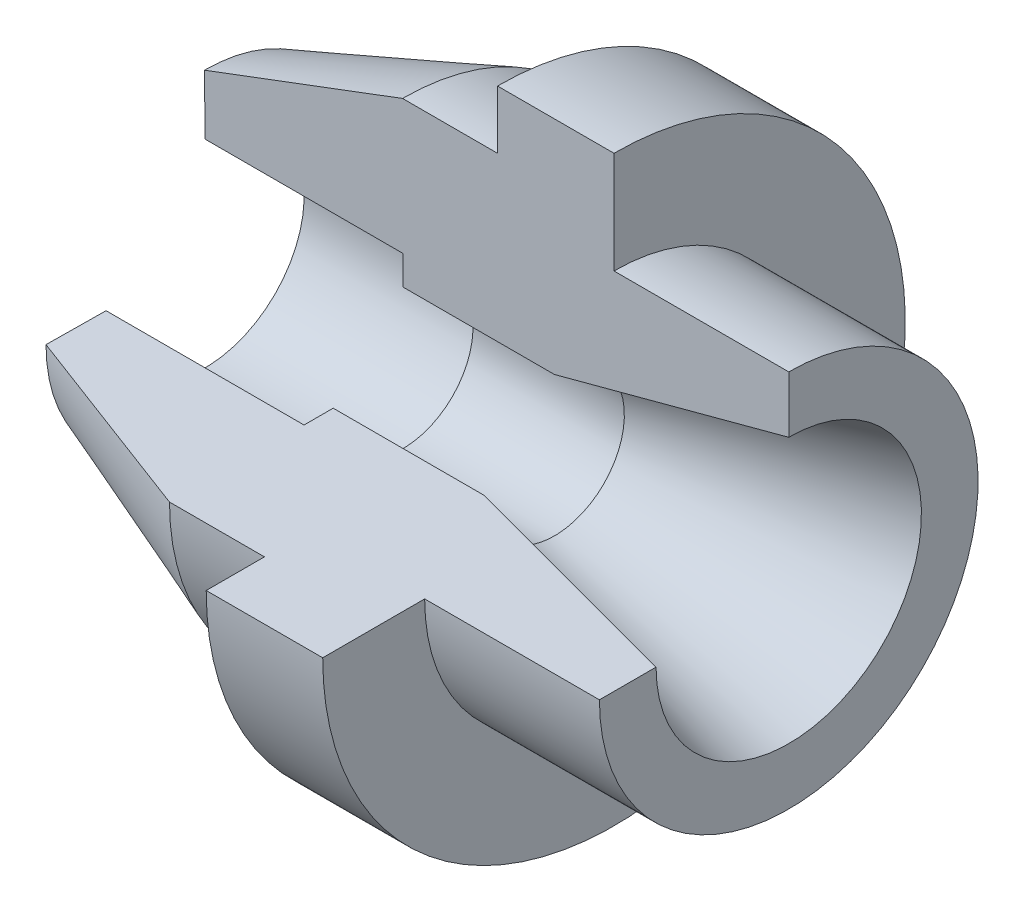
ISO-10303-21;
HEADER;
FILE_DESCRIPTION(('STEP AP214'),'2;1');
FILE_NAME('part.step','',(''),(''),'','','');
FILE_SCHEMA(('AUTOMOTIVE_DESIGN { 1 0 10303 214 1 1 1 1 }'));
ENDSEC;
DATA;
#1=APPLICATION_CONTEXT('core data for automotive mechanical design processes');
#2=APPLICATION_PROTOCOL_DEFINITION('international standard','automotive_design',2000,#1);
#3=PRODUCT_CONTEXT('',#1,'mechanical');
#4=PRODUCT('Part','Part','',(#3));
#5=PRODUCT_RELATED_PRODUCT_CATEGORY('part','',(#4));
#6=PRODUCT_DEFINITION_FORMATION('','',#4);
#7=PRODUCT_DEFINITION_CONTEXT('part definition',#1,'design');
#8=PRODUCT_DEFINITION('design','',#6,#7);
#9=PRODUCT_DEFINITION_SHAPE('','',#8);
#10=(LENGTH_UNIT() NAMED_UNIT(*) SI_UNIT(.MILLI.,.METRE.));
#11=(NAMED_UNIT(*) PLANE_ANGLE_UNIT() SI_UNIT($,.RADIAN.));
#12=(NAMED_UNIT(*) SI_UNIT($,.STERADIAN.) SOLID_ANGLE_UNIT());
#13=UNCERTAINTY_MEASURE_WITH_UNIT(LENGTH_MEASURE(1.E-05),#10,'distance_accuracy_value','');
#14=(GEOMETRIC_REPRESENTATION_CONTEXT(3) GLOBAL_UNCERTAINTY_ASSIGNED_CONTEXT((#13)) GLOBAL_UNIT_ASSIGNED_CONTEXT((#10,
#11,#12)) REPRESENTATION_CONTEXT('',''));
#15=CARTESIAN_POINT('',(0.,0.,0.));
#16=DIRECTION('',(0.,0.,1.));
#17=DIRECTION('',(1.,0.,0.));
#18=AXIS2_PLACEMENT_3D('',#15,#16,#17);
#19=CARTESIAN_POINT('',(-50.3001771515736,-25.,0.));
#20=DIRECTION('',(-1.,0.,0.));
#21=DIRECTION('',(0.,0.,1.));
#22=AXIS2_PLACEMENT_3D('',#19,#20,#21);
#23=CONICAL_SURFACE('',#22,27.1983435833448,1.55976017807853);
#24=CARTESIAN_POINT('',(-50.1876221454852,-24.9999999999991,0.));
#25=DIRECTION('',(1.,0.,0.));
#26=DIRECTION('',(0.,1.,0.));
#27=AXIS2_PLACEMENT_3D('',#24,#25,#26);
#28=CIRCLE('',#27,17.0000000000002);
#29=CARTESIAN_POINT('',(-50.1876221454852,-24.9999999999996,17.0000000000002));
#30=VERTEX_POINT('',#29);
#31=CARTESIAN_POINT('',(-50.1876221454852,-7.99999999999899,0.));
#32=VERTEX_POINT('',#31);
#33=EDGE_CURVE('E141',#30,#32,#28,.T.);
#34=ORIENTED_EDGE('',*,*,#33,.T.);
#35=DIRECTION('',(0.0110359246902061,-0.999939102328853,0.));
#36=VECTOR('',#35,1.);
#37=CARTESIAN_POINT('',(-50.,-25.,0.));
#38=LINE('',#37,#36);
#39=CARTESIAN_POINT('',(-50.3001771515736,2.19834358334479,0.));
#40=VERTEX_POINT('',#39);
#41=EDGE_CURVE('E159',#40,#32,#38,.T.);
#42=ORIENTED_EDGE('',*,*,#41,.F.);
#43=CARTESIAN_POINT('',(-50.3001771515736,-25.,0.));
#44=DIRECTION('',(1.,0.,0.));
#45=DIRECTION('',(0.,0.,-1.));
#46=AXIS2_PLACEMENT_3D('',#43,#44,#45);
#47=CIRCLE('',#46,27.1983435833448);
#48=CARTESIAN_POINT('',(-50.3001771515736,-24.9999999999991,27.1983435833448));
#49=VERTEX_POINT('',#48);
#50=EDGE_CURVE('E66',#49,#40,#47,.T.);
#51=ORIENTED_EDGE('',*,*,#50,.F.);
#52=DIRECTION('',(0.0110359246902061,0.,-0.999939102328853));
#53=VECTOR('',#52,1.);
#54=CARTESIAN_POINT('',(-50.,-25.,0.));
#55=LINE('',#54,#53);
#56=EDGE_CURVE('E188',#49,#30,#55,.T.);
#57=ORIENTED_EDGE('',*,*,#56,.T.);
#58=EDGE_LOOP('',(#34,#42,#51,#57));
#59=FACE_BOUND('',#58,.T.);
#60=ADVANCED_FACE('F43',(#59),#23,.F.);
#61=CARTESIAN_POINT('',(-16.3001771515736,-25.,0.));
#62=DIRECTION('',(1.,0.,0.));
#63=DIRECTION('',(0.,0.,-1.));
#64=AXIS2_PLACEMENT_3D('',#61,#62,#63);
#65=CONICAL_SURFACE('',#64,40.,0.36010199911523);
#66=CARTESIAN_POINT('',(-16.3001771515736,-25.,0.));
#67=DIRECTION('',(1.,0.,0.));
#68=DIRECTION('',(0.,0.,-1.));
#69=AXIS2_PLACEMENT_3D('',#66,#67,#68);
#70=CIRCLE('',#69,40.);
#71=CARTESIAN_POINT('',(-16.3001771515736,-24.9999999999987,40.));
#72=VERTEX_POINT('',#71);
#73=CARTESIAN_POINT('',(-16.3001771515736,15.,0.));
#74=VERTEX_POINT('',#73);
#75=EDGE_CURVE('E206',#72,#74,#70,.T.);
#76=ORIENTED_EDGE('',*,*,#75,.F.);
#77=DIRECTION('',(-0.935860887149434,0.,-0.352369692090388));
#78=VECTOR('',#77,1.);
#79=CARTESIAN_POINT('',(-50.3001771515736,-24.9999999999991,27.1983435833448));
#80=LINE('',#79,#78);
#81=EDGE_CURVE('E185',#72,#49,#80,.T.);
#82=ORIENTED_EDGE('',*,*,#81,.T.);
#83=ORIENTED_EDGE('',*,*,#50,.T.);
#84=DIRECTION('',(-0.935860887149434,-0.352369692090388,0.));
#85=VECTOR('',#84,1.);
#86=CARTESIAN_POINT('',(-50.3001771515736,2.19834358334479,0.));
#87=LINE('',#86,#85);
#88=EDGE_CURVE('E166',#74,#40,#87,.T.);
#89=ORIENTED_EDGE('',*,*,#88,.F.);
#90=EDGE_LOOP('',(#76,#82,#83,#89));
#91=FACE_BOUND('',#90,.T.);
#92=ADVANCED_FACE('F289',(#91),#65,.T.);
#93=CARTESIAN_POINT('',(50.,-25.,0.));
#94=DIRECTION('',(1.,0.,0.));
#95=DIRECTION('',(0.,0.,-1.));
#96=AXIS2_PLACEMENT_3D('',#93,#94,#95);
#97=CYLINDRICAL_SURFACE('',#96,40.);
#98=CARTESIAN_POINT('',(0.,-25.,0.));
#99=DIRECTION('',(1.,0.,0.));
#100=DIRECTION('',(0.,0.,-1.));
#101=AXIS2_PLACEMENT_3D('',#98,#99,#100);
#102=CIRCLE('',#101,40.);
#103=CARTESIAN_POINT('',(0.,-24.9999999999987,40.));
#104=VERTEX_POINT('',#103);
#105=CARTESIAN_POINT('',(0.,15.,0.));
#106=VERTEX_POINT('',#105);
#107=EDGE_CURVE('E203',#104,#106,#102,.T.);
#108=ORIENTED_EDGE('',*,*,#107,.F.);
#109=DIRECTION('',(-1.,0.,0.));
#110=VECTOR('',#109,1.);
#111=CARTESIAN_POINT('',(-16.3001771515736,-24.9999999999987,40.));
#112=LINE('',#111,#110);
#113=EDGE_CURVE('E181',#104,#72,#112,.T.);
#114=ORIENTED_EDGE('',*,*,#113,.T.);
#115=ORIENTED_EDGE('',*,*,#75,.T.);
#116=DIRECTION('',(-1.,0.,0.));
#117=VECTOR('',#116,1.);
#118=CARTESIAN_POINT('',(-16.3001771515736,15.,0.));
#119=LINE('',#118,#117);
#120=EDGE_CURVE('E267',#106,#74,#119,.T.);
#121=ORIENTED_EDGE('',*,*,#120,.F.);
#122=EDGE_LOOP('',(#108,#114,#115,#121));
#123=FACE_BOUND('',#122,.T.);
#124=ADVANCED_FACE('F293',(#123),#97,.T.);
#125=CARTESIAN_POINT('',(0.,-24.9999999999987,40.));
#126=DIRECTION('',(-1.,0.,0.));
#127=DIRECTION('',(0.,0.,1.));
#128=AXIS2_PLACEMENT_3D('',#125,#126,#127);
#129=PLANE('',#128);
#130=CARTESIAN_POINT('',(0.,-25.,0.));
#131=DIRECTION('',(1.,0.,0.));
#132=DIRECTION('',(0.,0.,-1.));
#133=AXIS2_PLACEMENT_3D('',#130,#131,#132);
#134=CIRCLE('',#133,50.);
#135=CARTESIAN_POINT('',(0.,-24.9999999999984,50.));
#136=VERTEX_POINT('',#135);
#137=CARTESIAN_POINT('',(0.,25.,0.));
#138=VERTEX_POINT('',#137);
#139=EDGE_CURVE('E200',#136,#138,#134,.T.);
#140=ORIENTED_EDGE('',*,*,#139,.F.);
#141=DIRECTION('',(0.,0.,-1.));
#142=VECTOR('',#141,1.);
#143=CARTESIAN_POINT('',(0.,-24.9999999999987,40.));
#144=LINE('',#143,#142);
#145=EDGE_CURVE('E177',#136,#104,#144,.T.);
#146=ORIENTED_EDGE('',*,*,#145,.T.);
#147=ORIENTED_EDGE('',*,*,#107,.T.);
#148=DIRECTION('',(0.,-1.,0.));
#149=VECTOR('',#148,1.);
#150=CARTESIAN_POINT('',(0.,15.,0.));
#151=LINE('',#150,#149);
#152=EDGE_CURVE('E263',#138,#106,#151,.T.);
#153=ORIENTED_EDGE('',*,*,#152,.F.);
#154=EDGE_LOOP('',(#140,#146,#147,#153));
#155=FACE_BOUND('',#154,.T.);
#156=ADVANCED_FACE('F297',(#155),#129,.T.);
#157=CARTESIAN_POINT('',(50.,-25.,0.));
#158=DIRECTION('',(1.,0.,0.));
#159=DIRECTION('',(0.,0.,-1.));
#160=AXIS2_PLACEMENT_3D('',#157,#158,#159);
#161=CYLINDRICAL_SURFACE('',#160,50.);
#162=CARTESIAN_POINT('',(20.,-25.,0.));
#163=DIRECTION('',(1.,0.,0.));
#164=DIRECTION('',(0.,0.,-1.));
#165=AXIS2_PLACEMENT_3D('',#162,#163,#164);
#166=CIRCLE('',#165,50.);
#167=CARTESIAN_POINT('',(20.,-24.9999999999984,50.));
#168=VERTEX_POINT('',#167);
#169=CARTESIAN_POINT('',(20.,25.,0.));
#170=VERTEX_POINT('',#169);
#171=EDGE_CURVE('E197',#168,#170,#166,.T.);
#172=ORIENTED_EDGE('',*,*,#171,.F.);
#173=DIRECTION('',(-1.,0.,0.));
#174=VECTOR('',#173,1.);
#175=CARTESIAN_POINT('',(0.,-24.9999999999984,50.));
#176=LINE('',#175,#174);
#177=EDGE_CURVE('E173',#168,#136,#176,.T.);
#178=ORIENTED_EDGE('',*,*,#177,.T.);
#179=ORIENTED_EDGE('',*,*,#139,.T.);
#180=DIRECTION('',(-1.,0.,0.));
#181=VECTOR('',#180,1.);
#182=CARTESIAN_POINT('',(0.,25.,0.));
#183=LINE('',#182,#181);
#184=EDGE_CURVE('E259',#170,#138,#183,.T.);
#185=ORIENTED_EDGE('',*,*,#184,.F.);
#186=EDGE_LOOP('',(#172,#178,#179,#185));
#187=FACE_BOUND('',#186,.T.);
#188=ADVANCED_FACE('F303',(#187),#161,.T.);
#189=CARTESIAN_POINT('',(20.,-24.9999999999984,50.));
#190=DIRECTION('',(1.,0.,0.));
#191=DIRECTION('',(0.,0.,-1.));
#192=AXIS2_PLACEMENT_3D('',#189,#190,#191);
#193=PLANE('',#192);
#194=CARTESIAN_POINT('',(20.,-25.,0.));
#195=DIRECTION('',(1.,0.,0.));
#196=DIRECTION('',(0.,0.,-1.));
#197=AXIS2_PLACEMENT_3D('',#194,#195,#196);
#198=CIRCLE('',#197,32.5);
#199=CARTESIAN_POINT('',(20.,-24.999999999999,32.5));
#200=VERTEX_POINT('',#199);
#201=CARTESIAN_POINT('',(20.,7.49999999999999,0.));
#202=VERTEX_POINT('',#201);
#203=EDGE_CURVE('E194',#200,#202,#198,.T.);
#204=ORIENTED_EDGE('',*,*,#203,.F.);
#205=DIRECTION('',(0.,0.,1.));
#206=VECTOR('',#205,1.);
#207=CARTESIAN_POINT('',(20.,-24.9999999999984,50.));
#208=LINE('',#207,#206);
#209=EDGE_CURVE('E163',#200,#168,#208,.T.);
#210=ORIENTED_EDGE('',*,*,#209,.T.);
#211=ORIENTED_EDGE('',*,*,#171,.T.);
#212=DIRECTION('',(0.,1.,0.));
#213=VECTOR('',#212,1.);
#214=CARTESIAN_POINT('',(20.,25.,0.));
#215=LINE('',#214,#213);
#216=EDGE_CURVE('E255',#202,#170,#215,.T.);
#217=ORIENTED_EDGE('',*,*,#216,.F.);
#218=EDGE_LOOP('',(#204,#210,#211,#217));
#219=FACE_BOUND('',#218,.T.);
#220=ADVANCED_FACE('F307',(#219),#193,.T.);
#221=CARTESIAN_POINT('',(50.,-25.,0.));
#222=DIRECTION('',(1.,0.,0.));
#223=DIRECTION('',(0.,0.,-1.));
#224=AXIS2_PLACEMENT_3D('',#221,#222,#223);
#225=CYLINDRICAL_SURFACE('',#224,32.5);
#226=CARTESIAN_POINT('',(50.,-25.,0.));
#227=DIRECTION('',(1.,0.,0.));
#228=DIRECTION('',(0.,0.,-1.));
#229=AXIS2_PLACEMENT_3D('',#226,#227,#228);
#230=CIRCLE('',#229,32.5);
#231=CARTESIAN_POINT('',(50.,-24.999999999999,32.5));
#232=VERTEX_POINT('',#231);
#233=CARTESIAN_POINT('',(50.,7.49999999999999,0.));
#234=VERTEX_POINT('',#233);
#235=EDGE_CURVE('E191',#232,#234,#230,.T.);
#236=ORIENTED_EDGE('',*,*,#235,.F.);
#237=DIRECTION('',(-1.,0.,0.));
#238=VECTOR('',#237,1.);
#239=CARTESIAN_POINT('',(20.,-24.999999999999,32.5));
#240=LINE('',#239,#238);
#241=EDGE_CURVE('E157',#232,#200,#240,.T.);
#242=ORIENTED_EDGE('',*,*,#241,.T.);
#243=ORIENTED_EDGE('',*,*,#203,.T.);
#244=DIRECTION('',(-1.,0.,0.));
#245=VECTOR('',#244,1.);
#246=CARTESIAN_POINT('',(20.,7.49999999999999,0.));
#247=LINE('',#246,#245);
#248=EDGE_CURVE('E251',#234,#202,#247,.T.);
#249=ORIENTED_EDGE('',*,*,#248,.F.);
#250=EDGE_LOOP('',(#236,#242,#243,#249));
#251=FACE_BOUND('',#250,.T.);
#252=ADVANCED_FACE('F311',(#251),#225,.T.);
#253=CARTESIAN_POINT('',(50.,-24.999999999999,32.5));
#254=DIRECTION('',(1.,0.,0.));
#255=DIRECTION('',(0.,0.,-1.));
#256=AXIS2_PLACEMENT_3D('',#253,#254,#255);
#257=PLANE('',#256);
#258=CARTESIAN_POINT('',(50.,-24.999999999999,0.));
#259=DIRECTION('',(1.,0.,0.));
#260=DIRECTION('',(0.,1.,0.));
#261=AXIS2_PLACEMENT_3D('',#258,#259,#260);
#262=CIRCLE('',#261,22.7767588290189);
#263=CARTESIAN_POINT('',(50.,-24.9999999999993,22.7767588290189));
#264=VERTEX_POINT('',#263);
#265=CARTESIAN_POINT('',(50.,-2.22324117098005,0.));
#266=VERTEX_POINT('',#265);
#267=EDGE_CURVE('E58',#264,#266,#262,.T.);
#268=ORIENTED_EDGE('',*,*,#267,.F.);
#269=DIRECTION('',(0.,0.,1.));
#270=VECTOR('',#269,1.);
#271=CARTESIAN_POINT('',(50.,-24.999999999999,32.5));
#272=LINE('',#271,#270);
#273=EDGE_CURVE('E147',#264,#232,#272,.T.);
#274=ORIENTED_EDGE('',*,*,#273,.T.);
#275=ORIENTED_EDGE('',*,*,#235,.T.);
#276=DIRECTION('',(0.,1.,0.));
#277=VECTOR('',#276,1.);
#278=CARTESIAN_POINT('',(50.,7.49999999999999,0.));
#279=LINE('',#278,#277);
#280=EDGE_CURVE('E149',#266,#234,#279,.T.);
#281=ORIENTED_EDGE('',*,*,#280,.F.);
#282=EDGE_LOOP('',(#268,#274,#275,#281));
#283=FACE_BOUND('',#282,.T.);
#284=ADVANCED_FACE('F145',(#283),#257,.T.);
#285=CARTESIAN_POINT('',(0.,-24.9999999999992,25.));
#286=DIRECTION('',(0.,1.,0.));
#287=DIRECTION('',(-1.,0.,0.));
#288=AXIS2_PLACEMENT_3D('',#285,#286,#287);
#289=PLANE('',#288);
#290=DIRECTION('',(1.,0.,0.));
#291=VECTOR('',#290,1.);
#292=CARTESIAN_POINT('',(50.,-24.9999999999995,17.0000000000001));
#293=LINE('',#292,#291);
#294=CARTESIAN_POINT('',(-16.2034291469357,-24.9999999999995,17.0000000000001));
#295=VERTEX_POINT('',#294);
#296=EDGE_CURVE('E233',#30,#295,#293,.T.);
#297=ORIENTED_EDGE('',*,*,#296,.F.);
#298=ORIENTED_EDGE('',*,*,#56,.F.);
#299=ORIENTED_EDGE('',*,*,#81,.F.);
#300=ORIENTED_EDGE('',*,*,#113,.F.);
#301=ORIENTED_EDGE('',*,*,#145,.F.);
#302=ORIENTED_EDGE('',*,*,#177,.F.);
#303=ORIENTED_EDGE('',*,*,#209,.F.);
#304=ORIENTED_EDGE('',*,*,#241,.F.);
#305=ORIENTED_EDGE('',*,*,#273,.F.);
#306=DIRECTION('',(0.96592582628907,0.,0.258819045102513));
#307=VECTOR('',#306,1.);
#308=CARTESIAN_POINT('',(-35.0040211816443,-25.,0.));
#309=LINE('',#308,#307);
#310=CARTESIAN_POINT('',(9.78058850918389,-24.9999999999995,12.0000000000001));
#311=VERTEX_POINT('',#310);
#312=EDGE_CURVE('E132',#311,#264,#309,.T.);
#313=ORIENTED_EDGE('',*,*,#312,.F.);
#314=DIRECTION('',(1.,0.,0.));
#315=VECTOR('',#314,1.);
#316=CARTESIAN_POINT('',(50.,-24.9999999999996,12.0000000000001));
#317=LINE('',#316,#315);
#318=CARTESIAN_POINT('',(-16.2034291469357,-24.9999999999997,12.0000000000001));
#319=VERTEX_POINT('',#318);
#320=EDGE_CURVE('E140',#319,#311,#317,.T.);
#321=ORIENTED_EDGE('',*,*,#320,.F.);
#322=DIRECTION('',(0.,0.,-1.));
#323=VECTOR('',#322,1.);
#324=CARTESIAN_POINT('',(-16.2034291469357,-24.9999999999992,25.));
#325=LINE('',#324,#323);
#326=EDGE_CURVE('E244',#295,#319,#325,.T.);
#327=ORIENTED_EDGE('',*,*,#326,.F.);
#328=EDGE_LOOP('',(#297,#298,#299,#300,#301,#302,#303,#304,#305,#313,#321,#327));
#329=FACE_BOUND('',#328,.T.);
#330=ADVANCED_FACE('F154',(#329),#289,.T.);
#331=CARTESIAN_POINT('',(0.,0.,0.));
#332=DIRECTION('',(0.,0.,-1.));
#333=DIRECTION('',(-1.,0.,0.));
#334=AXIS2_PLACEMENT_3D('',#331,#332,#333);
#335=PLANE('',#334);
#336=ORIENTED_EDGE('',*,*,#41,.T.);
#337=DIRECTION('',(1.,0.,0.));
#338=VECTOR('',#337,1.);
#339=CARTESIAN_POINT('',(50.,-7.99999999999884,0.));
#340=LINE('',#339,#338);
#341=CARTESIAN_POINT('',(-16.2034291469357,-7.99999999999899,0.));
#342=VERTEX_POINT('',#341);
#343=EDGE_CURVE('E11',#32,#342,#340,.T.);
#344=ORIENTED_EDGE('',*,*,#343,.T.);
#345=DIRECTION('',(0.,-1.,0.));
#346=VECTOR('',#345,1.);
#347=CARTESIAN_POINT('',(-16.2034291469357,0.,0.));
#348=LINE('',#347,#346);
#349=CARTESIAN_POINT('',(-16.2034291469357,-12.999999999999,0.));
#350=VERTEX_POINT('',#349);
#351=EDGE_CURVE('E51',#342,#350,#348,.T.);
#352=ORIENTED_EDGE('',*,*,#351,.T.);
#353=DIRECTION('',(1.,0.,0.));
#354=VECTOR('',#353,1.);
#355=CARTESIAN_POINT('',(50.,-12.9999999999989,0.));
#356=LINE('',#355,#354);
#357=CARTESIAN_POINT('',(9.78058850918387,-12.999999999999,0.));
#358=VERTEX_POINT('',#357);
#359=EDGE_CURVE('E214',#350,#358,#356,.T.);
#360=ORIENTED_EDGE('',*,*,#359,.T.);
#361=DIRECTION('',(0.96592582628907,0.258819045102515,0.));
#362=VECTOR('',#361,1.);
#363=CARTESIAN_POINT('',(-35.0040211816443,-24.9999999999991,0.));
#364=LINE('',#363,#362);
#365=EDGE_CURVE('E211',#358,#266,#364,.T.);
#366=ORIENTED_EDGE('',*,*,#365,.T.);
#367=ORIENTED_EDGE('',*,*,#280,.T.);
#368=ORIENTED_EDGE('',*,*,#248,.T.);
#369=ORIENTED_EDGE('',*,*,#216,.T.);
#370=ORIENTED_EDGE('',*,*,#184,.T.);
#371=ORIENTED_EDGE('',*,*,#152,.T.);
#372=ORIENTED_EDGE('',*,*,#120,.T.);
#373=ORIENTED_EDGE('',*,*,#88,.T.);
#374=EDGE_LOOP('',(#336,#344,#352,#360,#366,#367,#368,#369,#370,#371,#372,#373));
#375=FACE_BOUND('',#374,.T.);
#376=ADVANCED_FACE('F220',(#375),#335,.F.);
#377=CARTESIAN_POINT('',(50.,-24.999999999999,0.));
#378=DIRECTION('',(1.,0.,0.));
#379=DIRECTION('',(0.,1.,0.));
#380=AXIS2_PLACEMENT_3D('',#377,#378,#379);
#381=CYLINDRICAL_SURFACE('',#380,17.0000000000001);
#382=ORIENTED_EDGE('',*,*,#296,.T.);
#383=CARTESIAN_POINT('',(-16.2034291469357,-24.9999999999991,0.));
#384=DIRECTION('',(1.,0.,0.));
#385=DIRECTION('',(0.,1.,0.));
#386=AXIS2_PLACEMENT_3D('',#383,#384,#385);
#387=CIRCLE('',#386,17.0000000000001);
#388=EDGE_CURVE('E226',#295,#342,#387,.T.);
#389=ORIENTED_EDGE('',*,*,#388,.T.);
#390=ORIENTED_EDGE('',*,*,#343,.F.);
#391=ORIENTED_EDGE('',*,*,#33,.F.);
#392=EDGE_LOOP('',(#382,#389,#390,#391));
#393=FACE_BOUND('',#392,.T.);
#394=ADVANCED_FACE('F231',(#393),#381,.F.);
#395=CARTESIAN_POINT('',(-16.2034291469357,-7.99999999999899,0.));
#396=DIRECTION('',(1.,0.,0.));
#397=DIRECTION('',(0.,1.,0.));
#398=AXIS2_PLACEMENT_3D('',#395,#396,#397);
#399=PLANE('',#398);
#400=ORIENTED_EDGE('',*,*,#326,.T.);
#401=CARTESIAN_POINT('',(-16.2034291469357,-24.9999999999991,0.));
#402=DIRECTION('',(1.,0.,0.));
#403=DIRECTION('',(0.,1.,0.));
#404=AXIS2_PLACEMENT_3D('',#401,#402,#403);
#405=CIRCLE('',#404,12.0000000000001);
#406=EDGE_CURVE('E229',#319,#350,#405,.T.);
#407=ORIENTED_EDGE('',*,*,#406,.T.);
#408=ORIENTED_EDGE('',*,*,#351,.F.);
#409=ORIENTED_EDGE('',*,*,#388,.F.);
#410=EDGE_LOOP('',(#400,#407,#408,#409));
#411=FACE_BOUND('',#410,.T.);
#412=ADVANCED_FACE('F225',(#411),#399,.F.);
#413=CARTESIAN_POINT('',(50.,-24.999999999999,0.));
#414=DIRECTION('',(1.,0.,0.));
#415=DIRECTION('',(0.,1.,0.));
#416=AXIS2_PLACEMENT_3D('',#413,#414,#415);
#417=CYLINDRICAL_SURFACE('',#416,12.0000000000001);
#418=ORIENTED_EDGE('',*,*,#320,.T.);
#419=CARTESIAN_POINT('',(9.78058850918389,-24.999999999999,0.));
#420=DIRECTION('',(1.,0.,0.));
#421=DIRECTION('',(0.,1.,0.));
#422=AXIS2_PLACEMENT_3D('',#419,#420,#421);
#423=CIRCLE('',#422,12.0000000000001);
#424=EDGE_CURVE('E135',#311,#358,#423,.T.);
#425=ORIENTED_EDGE('',*,*,#424,.T.);
#426=ORIENTED_EDGE('',*,*,#359,.F.);
#427=ORIENTED_EDGE('',*,*,#406,.F.);
#428=EDGE_LOOP('',(#418,#425,#426,#427));
#429=FACE_BOUND('',#428,.T.);
#430=ADVANCED_FACE('F278',(#429),#417,.F.);
#431=CARTESIAN_POINT('',(50.,-24.999999999999,0.));
#432=DIRECTION('',(1.,0.,0.));
#433=DIRECTION('',(0.,1.,0.));
#434=AXIS2_PLACEMENT_3D('',#431,#432,#433);
#435=CONICAL_SURFACE('',#434,22.7767588290189,0.261799387799141);
#436=ORIENTED_EDGE('',*,*,#312,.T.);
#437=ORIENTED_EDGE('',*,*,#267,.T.);
#438=ORIENTED_EDGE('',*,*,#365,.F.);
#439=ORIENTED_EDGE('',*,*,#424,.F.);
#440=EDGE_LOOP('',(#436,#437,#438,#439));
#441=FACE_BOUND('',#440,.T.);
#442=ADVANCED_FACE('F133',(#441),#435,.F.);
#443=CLOSED_SHELL('',(#60,#92,#124,#156,#188,#220,#252,#284,#330,#376,#394,#412,#430,#442));
#444=MANIFOLD_SOLID_BREP('B2',#443);
#445=ADVANCED_BREP_SHAPE_REPRESENTATION('',(#18,#444),#14);
#446=SHAPE_DEFINITION_REPRESENTATION(#9,#445);
ENDSEC;
END-ISO-10303-21;
